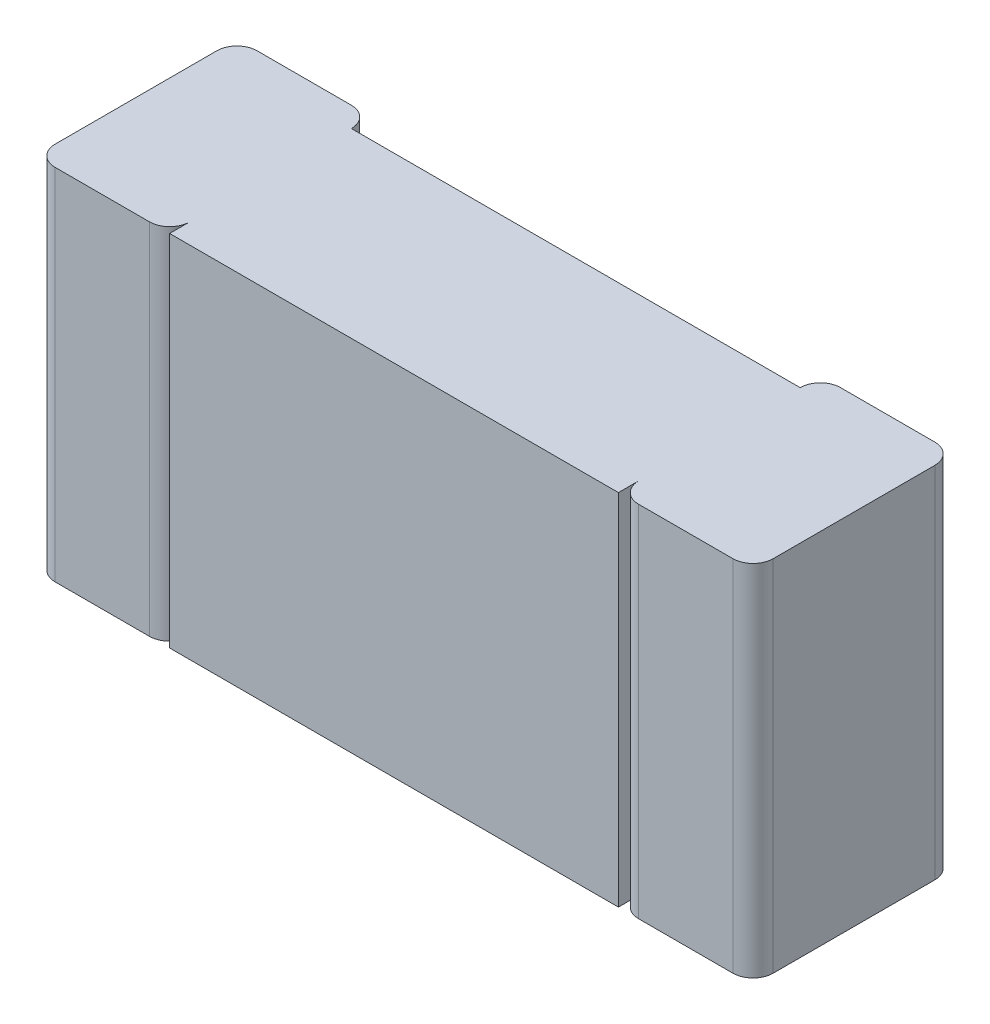
ISO-10303-21;
HEADER;
FILE_DESCRIPTION(('STEP AP214'),'2;1');
FILE_NAME('part.step','',(''),(''),'','','');
FILE_SCHEMA(('AUTOMOTIVE_DESIGN { 1 0 10303 214 1 1 1 1 }'));
ENDSEC;
DATA;
#1=APPLICATION_CONTEXT('core data for automotive mechanical design processes');
#2=APPLICATION_PROTOCOL_DEFINITION('international standard','automotive_design',2000,#1);
#3=PRODUCT_CONTEXT('',#1,'mechanical');
#4=PRODUCT('Part','Part','',(#3));
#5=PRODUCT_RELATED_PRODUCT_CATEGORY('part','',(#4));
#6=PRODUCT_DEFINITION_FORMATION('','',#4);
#7=PRODUCT_DEFINITION_CONTEXT('part definition',#1,'design');
#8=PRODUCT_DEFINITION('design','',#6,#7);
#9=PRODUCT_DEFINITION_SHAPE('','',#8);
#10=(LENGTH_UNIT() NAMED_UNIT(*) SI_UNIT(.MILLI.,.METRE.));
#11=(NAMED_UNIT(*) PLANE_ANGLE_UNIT() SI_UNIT($,.RADIAN.));
#12=(NAMED_UNIT(*) SI_UNIT($,.STERADIAN.) SOLID_ANGLE_UNIT());
#13=UNCERTAINTY_MEASURE_WITH_UNIT(LENGTH_MEASURE(1.E-05),#10,'distance_accuracy_value','');
#14=(GEOMETRIC_REPRESENTATION_CONTEXT(3) GLOBAL_UNCERTAINTY_ASSIGNED_CONTEXT((#13)) GLOBAL_UNIT_ASSIGNED_CONTEXT((#10,
#11,#12)) REPRESENTATION_CONTEXT('',''));
#15=CARTESIAN_POINT('',(0.,0.,0.));
#16=DIRECTION('',(0.,0.,1.));
#17=DIRECTION('',(1.,0.,0.));
#18=AXIS2_PLACEMENT_3D('',#15,#16,#17);
#19=CARTESIAN_POINT('',(-0.755,-0.4,0.045));
#20=DIRECTION('',(0.,1.,0.));
#21=DIRECTION('',(0.,0.,1.));
#22=AXIS2_PLACEMENT_3D('',#19,#20,#21);
#23=CYLINDRICAL_SURFACE('',#22,0.045);
#24=DIRECTION('',(0.,1.,0.));
#25=VECTOR('',#24,1.);
#26=CARTESIAN_POINT('',(-0.755,-0.4,0.));
#27=LINE('',#26,#25);
#28=CARTESIAN_POINT('',(-0.755,0.4,0.));
#29=VERTEX_POINT('',#28);
#30=CARTESIAN_POINT('',(-0.755,-0.4,0.));
#31=VERTEX_POINT('',#30);
#32=EDGE_CURVE('E129',#29,#31,#27,.F.);
#33=ORIENTED_EDGE('',*,*,#32,.T.);
#34=CARTESIAN_POINT('',(-0.755,-0.4,0.045));
#35=DIRECTION('',(0.,1.,0.));
#36=DIRECTION('',(0.,0.,1.));
#37=AXIS2_PLACEMENT_3D('',#34,#35,#36);
#38=CIRCLE('',#37,0.045);
#39=CARTESIAN_POINT('',(-0.8,-0.4,0.045));
#40=VERTEX_POINT('',#39);
#41=EDGE_CURVE('E20',#31,#40,#38,.T.);
#42=ORIENTED_EDGE('',*,*,#41,.T.);
#43=DIRECTION('',(0.,1.,0.));
#44=VECTOR('',#43,1.);
#45=CARTESIAN_POINT('',(-0.8,-0.4,0.045));
#46=LINE('',#45,#44);
#47=CARTESIAN_POINT('',(-0.8,0.4,0.045));
#48=VERTEX_POINT('',#47);
#49=EDGE_CURVE('E136',#40,#48,#46,.T.);
#50=ORIENTED_EDGE('',*,*,#49,.T.);
#51=CARTESIAN_POINT('',(-0.755,0.4,0.045));
#52=DIRECTION('',(0.,1.,0.));
#53=DIRECTION('',(0.,0.,1.));
#54=AXIS2_PLACEMENT_3D('',#51,#52,#53);
#55=CIRCLE('',#54,0.045);
#56=EDGE_CURVE('E232',#29,#48,#55,.T.);
#57=ORIENTED_EDGE('',*,*,#56,.F.);
#58=EDGE_LOOP('',(#33,#42,#50,#57));
#59=FACE_BOUND('',#58,.T.);
#60=ADVANCED_FACE('F17',(#59),#23,.T.);
#61=CARTESIAN_POINT('',(-0.8,-0.4,0.));
#62=DIRECTION('',(1.,0.,0.));
#63=DIRECTION('',(0.,0.,-1.));
#64=AXIS2_PLACEMENT_3D('',#61,#62,#63);
#65=PLANE('',#64);
#66=DIRECTION('',(0.,0.,1.));
#67=VECTOR('',#66,1.);
#68=CARTESIAN_POINT('',(-0.8,0.4,0.));
#69=LINE('',#68,#67);
#70=CARTESIAN_POINT('',(-0.8,0.4,0.405));
#71=VERTEX_POINT('',#70);
#72=EDGE_CURVE('E141',#48,#71,#69,.T.);
#73=ORIENTED_EDGE('',*,*,#72,.F.);
#74=ORIENTED_EDGE('',*,*,#49,.F.);
#75=DIRECTION('',(0.,0.,1.));
#76=VECTOR('',#75,1.);
#77=CARTESIAN_POINT('',(-0.8,-0.4,0.));
#78=LINE('',#77,#76);
#79=CARTESIAN_POINT('',(-0.8,-0.4,0.405));
#80=VERTEX_POINT('',#79);
#81=EDGE_CURVE('E140',#40,#80,#78,.T.);
#82=ORIENTED_EDGE('',*,*,#81,.T.);
#83=DIRECTION('',(0.,1.,0.));
#84=VECTOR('',#83,1.);
#85=CARTESIAN_POINT('',(-0.8,-0.4,0.405));
#86=LINE('',#85,#84);
#87=EDGE_CURVE('E142',#71,#80,#86,.F.);
#88=ORIENTED_EDGE('',*,*,#87,.F.);
#89=EDGE_LOOP('',(#73,#74,#82,#88));
#90=FACE_BOUND('',#89,.T.);
#91=ADVANCED_FACE('F138',(#90),#65,.F.);
#92=CARTESIAN_POINT('',(-0.755,-0.4,0.405));
#93=DIRECTION('',(0.,1.,0.));
#94=DIRECTION('',(0.,0.,1.));
#95=AXIS2_PLACEMENT_3D('',#92,#93,#94);
#96=CYLINDRICAL_SURFACE('',#95,0.045);
#97=CARTESIAN_POINT('',(-0.755,0.4,0.405));
#98=DIRECTION('',(0.,1.,0.));
#99=DIRECTION('',(0.,0.,1.));
#100=AXIS2_PLACEMENT_3D('',#97,#98,#99);
#101=CIRCLE('',#100,0.045);
#102=CARTESIAN_POINT('',(-0.755,0.4,0.45));
#103=VERTEX_POINT('',#102);
#104=EDGE_CURVE('E230',#71,#103,#101,.T.);
#105=ORIENTED_EDGE('',*,*,#104,.F.);
#106=ORIENTED_EDGE('',*,*,#87,.T.);
#107=CARTESIAN_POINT('',(-0.755,-0.4,0.405));
#108=DIRECTION('',(0.,1.,0.));
#109=DIRECTION('',(0.,0.,1.));
#110=AXIS2_PLACEMENT_3D('',#107,#108,#109);
#111=CIRCLE('',#110,0.045);
#112=CARTESIAN_POINT('',(-0.755,-0.4,0.45));
#113=VERTEX_POINT('',#112);
#114=EDGE_CURVE('E151',#80,#113,#111,.T.);
#115=ORIENTED_EDGE('',*,*,#114,.T.);
#116=DIRECTION('',(0.,1.,0.));
#117=VECTOR('',#116,1.);
#118=CARTESIAN_POINT('',(-0.755,-0.4,0.45));
#119=LINE('',#118,#117);
#120=EDGE_CURVE('E200',#103,#113,#119,.F.);
#121=ORIENTED_EDGE('',*,*,#120,.F.);
#122=EDGE_LOOP('',(#105,#106,#115,#121));
#123=FACE_BOUND('',#122,.T.);
#124=ADVANCED_FACE('F452',(#123),#96,.T.);
#125=CARTESIAN_POINT('',(-0.8,-0.4,0.45));
#126=DIRECTION('',(0.,0.,1.));
#127=DIRECTION('',(1.,0.,0.));
#128=AXIS2_PLACEMENT_3D('',#125,#126,#127);
#129=PLANE('',#128);
#130=DIRECTION('',(1.,0.,0.));
#131=VECTOR('',#130,1.);
#132=CARTESIAN_POINT('',(-0.8,-0.4,0.45));
#133=LINE('',#132,#131);
#134=CARTESIAN_POINT('',(-0.545,-0.4,0.45));
#135=VERTEX_POINT('',#134);
#136=EDGE_CURVE('E248',#113,#135,#133,.T.);
#137=ORIENTED_EDGE('',*,*,#136,.T.);
#138=DIRECTION('',(0.,1.,0.));
#139=VECTOR('',#138,1.);
#140=CARTESIAN_POINT('',(-0.545,-0.4,0.45));
#141=LINE('',#140,#139);
#142=CARTESIAN_POINT('',(-0.545,0.4,0.45));
#143=VERTEX_POINT('',#142);
#144=EDGE_CURVE('E198',#143,#135,#141,.F.);
#145=ORIENTED_EDGE('',*,*,#144,.F.);
#146=DIRECTION('',(1.,0.,0.));
#147=VECTOR('',#146,1.);
#148=CARTESIAN_POINT('',(-0.8,0.4,0.45));
#149=LINE('',#148,#147);
#150=EDGE_CURVE('E229',#103,#143,#149,.T.);
#151=ORIENTED_EDGE('',*,*,#150,.F.);
#152=ORIENTED_EDGE('',*,*,#120,.T.);
#153=EDGE_LOOP('',(#137,#145,#151,#152));
#154=FACE_BOUND('',#153,.T.);
#155=ADVANCED_FACE('F442',(#154),#129,.T.);
#156=CARTESIAN_POINT('',(-0.545,-0.4,0.405));
#157=DIRECTION('',(0.,1.,0.));
#158=DIRECTION('',(0.,0.,1.));
#159=AXIS2_PLACEMENT_3D('',#156,#157,#158);
#160=CYLINDRICAL_SURFACE('',#159,0.045);
#161=ORIENTED_EDGE('',*,*,#144,.T.);
#162=CARTESIAN_POINT('',(-0.545,-0.4,0.405));
#163=DIRECTION('',(0.,1.,0.));
#164=DIRECTION('',(0.,0.,1.));
#165=AXIS2_PLACEMENT_3D('',#162,#163,#164);
#166=CIRCLE('',#165,0.045);
#167=CARTESIAN_POINT('',(-0.5,-0.4,0.405));
#168=VERTEX_POINT('',#167);
#169=EDGE_CURVE('E246',#135,#168,#166,.T.);
#170=ORIENTED_EDGE('',*,*,#169,.T.);
#171=DIRECTION('',(0.,1.,0.));
#172=VECTOR('',#171,1.);
#173=CARTESIAN_POINT('',(-0.5,-0.4,0.405));
#174=LINE('',#173,#172);
#175=CARTESIAN_POINT('',(-0.5,0.4,0.405));
#176=VERTEX_POINT('',#175);
#177=EDGE_CURVE('E193',#168,#176,#174,.T.);
#178=ORIENTED_EDGE('',*,*,#177,.T.);
#179=CARTESIAN_POINT('',(-0.545,0.4,0.405));
#180=DIRECTION('',(0.,1.,0.));
#181=DIRECTION('',(0.,0.,1.));
#182=AXIS2_PLACEMENT_3D('',#179,#180,#181);
#183=CIRCLE('',#182,0.045);
#184=EDGE_CURVE('E227',#143,#176,#183,.T.);
#185=ORIENTED_EDGE('',*,*,#184,.F.);
#186=EDGE_LOOP('',(#161,#170,#178,#185));
#187=FACE_BOUND('',#186,.T.);
#188=ADVANCED_FACE('F430',(#187),#160,.T.);
#189=CARTESIAN_POINT('',(-0.5,-0.4,0.405));
#190=DIRECTION('',(1.,0.,0.));
#191=DIRECTION('',(0.,0.,-1.));
#192=AXIS2_PLACEMENT_3D('',#189,#190,#191);
#193=PLANE('',#192);
#194=DIRECTION('',(0.,0.,1.));
#195=VECTOR('',#194,1.);
#196=CARTESIAN_POINT('',(-0.5,0.4,0.405));
#197=LINE('',#196,#195);
#198=CARTESIAN_POINT('',(-0.5,0.4,0.45));
#199=VERTEX_POINT('',#198);
#200=EDGE_CURVE('E188',#176,#199,#197,.T.);
#201=ORIENTED_EDGE('',*,*,#200,.F.);
#202=ORIENTED_EDGE('',*,*,#177,.F.);
#203=DIRECTION('',(0.,0.,1.));
#204=VECTOR('',#203,1.);
#205=CARTESIAN_POINT('',(-0.5,-0.4,0.405));
#206=LINE('',#205,#204);
#207=CARTESIAN_POINT('',(-0.5,-0.4,0.45));
#208=VERTEX_POINT('',#207);
#209=EDGE_CURVE('E206',#168,#208,#206,.T.);
#210=ORIENTED_EDGE('',*,*,#209,.T.);
#211=DIRECTION('',(0.,1.,0.));
#212=VECTOR('',#211,1.);
#213=CARTESIAN_POINT('',(-0.5,-0.4,0.45));
#214=LINE('',#213,#212);
#215=EDGE_CURVE('E181',#199,#208,#214,.F.);
#216=ORIENTED_EDGE('',*,*,#215,.F.);
#217=EDGE_LOOP('',(#201,#202,#210,#216));
#218=FACE_BOUND('',#217,.T.);
#219=ADVANCED_FACE('F420',(#218),#193,.F.);
#220=CARTESIAN_POINT('',(-0.5,-0.4,0.45));
#221=DIRECTION('',(0.,0.,1.));
#222=DIRECTION('',(1.,0.,0.));
#223=AXIS2_PLACEMENT_3D('',#220,#221,#222);
#224=PLANE('',#223);
#225=DIRECTION('',(0.,1.,0.));
#226=VECTOR('',#225,1.);
#227=CARTESIAN_POINT('',(0.5,-0.4,0.45));
#228=LINE('',#227,#226);
#229=CARTESIAN_POINT('',(0.5,0.4,0.45));
#230=VERTEX_POINT('',#229);
#231=CARTESIAN_POINT('',(0.5,-0.4,0.45));
#232=VERTEX_POINT('',#231);
#233=EDGE_CURVE('E174',#230,#232,#228,.F.);
#234=ORIENTED_EDGE('',*,*,#233,.F.);
#235=DIRECTION('',(1.,0.,0.));
#236=VECTOR('',#235,1.);
#237=CARTESIAN_POINT('',(-0.5,0.4,0.45));
#238=LINE('',#237,#236);
#239=EDGE_CURVE('E184',#199,#230,#238,.T.);
#240=ORIENTED_EDGE('',*,*,#239,.F.);
#241=ORIENTED_EDGE('',*,*,#215,.T.);
#242=DIRECTION('',(1.,0.,0.));
#243=VECTOR('',#242,1.);
#244=CARTESIAN_POINT('',(-0.5,-0.4,0.45));
#245=LINE('',#244,#243);
#246=EDGE_CURVE('E203',#208,#232,#245,.T.);
#247=ORIENTED_EDGE('',*,*,#246,.T.);
#248=EDGE_LOOP('',(#234,#240,#241,#247));
#249=FACE_BOUND('',#248,.T.);
#250=ADVANCED_FACE('F407',(#249),#224,.T.);
#251=CARTESIAN_POINT('',(0.5,-0.4,0.405));
#252=DIRECTION('',(1.,0.,0.));
#253=DIRECTION('',(0.,0.,-1.));
#254=AXIS2_PLACEMENT_3D('',#251,#252,#253);
#255=PLANE('',#254);
#256=DIRECTION('',(0.,0.,1.));
#257=VECTOR('',#256,1.);
#258=CARTESIAN_POINT('',(0.5,0.4,0.405));
#259=LINE('',#258,#257);
#260=CARTESIAN_POINT('',(0.5,0.4,0.405));
#261=VERTEX_POINT('',#260);
#262=EDGE_CURVE('E187',#230,#261,#259,.F.);
#263=ORIENTED_EDGE('',*,*,#262,.F.);
#264=ORIENTED_EDGE('',*,*,#233,.T.);
#265=DIRECTION('',(0.,0.,1.));
#266=VECTOR('',#265,1.);
#267=CARTESIAN_POINT('',(0.5,-0.4,0.405));
#268=LINE('',#267,#266);
#269=CARTESIAN_POINT('',(0.5,-0.4,0.405));
#270=VERTEX_POINT('',#269);
#271=EDGE_CURVE('E178',#232,#270,#268,.F.);
#272=ORIENTED_EDGE('',*,*,#271,.T.);
#273=DIRECTION('',(0.,1.,0.));
#274=VECTOR('',#273,1.);
#275=CARTESIAN_POINT('',(0.5,-0.4,0.405));
#276=LINE('',#275,#274);
#277=EDGE_CURVE('E172',#261,#270,#276,.F.);
#278=ORIENTED_EDGE('',*,*,#277,.F.);
#279=EDGE_LOOP('',(#263,#264,#272,#278));
#280=FACE_BOUND('',#279,.T.);
#281=ADVANCED_FACE('F375',(#280),#255,.T.);
#282=CARTESIAN_POINT('',(0.545,-0.4,0.405));
#283=DIRECTION('',(0.,1.,0.));
#284=DIRECTION('',(0.,0.,1.));
#285=AXIS2_PLACEMENT_3D('',#282,#283,#284);
#286=CYLINDRICAL_SURFACE('',#285,0.045);
#287=CARTESIAN_POINT('',(0.545,0.4,0.405));
#288=DIRECTION('',(0.,1.,0.));
#289=DIRECTION('',(0.,0.,1.));
#290=AXIS2_PLACEMENT_3D('',#287,#288,#289);
#291=CIRCLE('',#290,0.045);
#292=CARTESIAN_POINT('',(0.545,0.4,0.45));
#293=VERTEX_POINT('',#292);
#294=EDGE_CURVE('E224',#261,#293,#291,.T.);
#295=ORIENTED_EDGE('',*,*,#294,.F.);
#296=ORIENTED_EDGE('',*,*,#277,.T.);
#297=CARTESIAN_POINT('',(0.545,-0.4,0.405));
#298=DIRECTION('',(0.,1.,0.));
#299=DIRECTION('',(0.,0.,1.));
#300=AXIS2_PLACEMENT_3D('',#297,#298,#299);
#301=CIRCLE('',#300,0.045);
#302=CARTESIAN_POINT('',(0.545,-0.4,0.45));
#303=VERTEX_POINT('',#302);
#304=EDGE_CURVE('E243',#270,#303,#301,.T.);
#305=ORIENTED_EDGE('',*,*,#304,.T.);
#306=DIRECTION('',(0.,1.,0.));
#307=VECTOR('',#306,1.);
#308=CARTESIAN_POINT('',(0.545,-0.4,0.45));
#309=LINE('',#308,#307);
#310=EDGE_CURVE('E170',#293,#303,#309,.F.);
#311=ORIENTED_EDGE('',*,*,#310,.F.);
#312=EDGE_LOOP('',(#295,#296,#305,#311));
#313=FACE_BOUND('',#312,.T.);
#314=ADVANCED_FACE('F406',(#313),#286,.T.);
#315=CARTESIAN_POINT('',(0.5,-0.4,0.45));
#316=DIRECTION('',(0.,0.,1.));
#317=DIRECTION('',(1.,0.,0.));
#318=AXIS2_PLACEMENT_3D('',#315,#316,#317);
#319=PLANE('',#318);
#320=DIRECTION('',(1.,0.,0.));
#321=VECTOR('',#320,1.);
#322=CARTESIAN_POINT('',(0.5,-0.4,0.45));
#323=LINE('',#322,#321);
#324=CARTESIAN_POINT('',(0.755,-0.4,0.45));
#325=VERTEX_POINT('',#324);
#326=EDGE_CURVE('E242',#303,#325,#323,.T.);
#327=ORIENTED_EDGE('',*,*,#326,.T.);
#328=DIRECTION('',(0.,1.,0.));
#329=VECTOR('',#328,1.);
#330=CARTESIAN_POINT('',(0.755,-0.4,0.45));
#331=LINE('',#330,#329);
#332=CARTESIAN_POINT('',(0.755,0.4,0.45));
#333=VERTEX_POINT('',#332);
#334=EDGE_CURVE('E168',#333,#325,#331,.F.);
#335=ORIENTED_EDGE('',*,*,#334,.F.);
#336=DIRECTION('',(1.,0.,0.));
#337=VECTOR('',#336,1.);
#338=CARTESIAN_POINT('',(0.5,0.4,0.45));
#339=LINE('',#338,#337);
#340=EDGE_CURVE('E223',#293,#333,#339,.T.);
#341=ORIENTED_EDGE('',*,*,#340,.F.);
#342=ORIENTED_EDGE('',*,*,#310,.T.);
#343=EDGE_LOOP('',(#327,#335,#341,#342));
#344=FACE_BOUND('',#343,.T.);
#345=ADVANCED_FACE('F483',(#344),#319,.T.);
#346=CARTESIAN_POINT('',(0.755,-0.4,0.405));
#347=DIRECTION('',(0.,1.,0.));
#348=DIRECTION('',(0.,0.,1.));
#349=AXIS2_PLACEMENT_3D('',#346,#347,#348);
#350=CYLINDRICAL_SURFACE('',#349,0.045);
#351=ORIENTED_EDGE('',*,*,#334,.T.);
#352=CARTESIAN_POINT('',(0.755,-0.4,0.405));
#353=DIRECTION('',(0.,1.,0.));
#354=DIRECTION('',(0.,0.,1.));
#355=AXIS2_PLACEMENT_3D('',#352,#353,#354);
#356=CIRCLE('',#355,0.045);
#357=CARTESIAN_POINT('',(0.8,-0.4,0.405));
#358=VERTEX_POINT('',#357);
#359=EDGE_CURVE('E239',#325,#358,#356,.T.);
#360=ORIENTED_EDGE('',*,*,#359,.T.);
#361=DIRECTION('',(0.,1.,0.));
#362=VECTOR('',#361,1.);
#363=CARTESIAN_POINT('',(0.8,-0.4,0.405));
#364=LINE('',#363,#362);
#365=CARTESIAN_POINT('',(0.8,0.4,0.405));
#366=VERTEX_POINT('',#365);
#367=EDGE_CURVE('E166',#366,#358,#364,.F.);
#368=ORIENTED_EDGE('',*,*,#367,.F.);
#369=CARTESIAN_POINT('',(0.755,0.4,0.405));
#370=DIRECTION('',(0.,1.,0.));
#371=DIRECTION('',(0.,0.,1.));
#372=AXIS2_PLACEMENT_3D('',#369,#370,#371);
#373=CIRCLE('',#372,0.045);
#374=EDGE_CURVE('E221',#333,#366,#373,.T.);
#375=ORIENTED_EDGE('',*,*,#374,.F.);
#376=EDGE_LOOP('',(#351,#360,#368,#375));
#377=FACE_BOUND('',#376,.T.);
#378=ADVANCED_FACE('F487',(#377),#350,.T.);
#379=CARTESIAN_POINT('',(0.8,-0.4,0.));
#380=DIRECTION('',(1.,0.,0.));
#381=DIRECTION('',(0.,0.,-1.));
#382=AXIS2_PLACEMENT_3D('',#379,#380,#381);
#383=PLANE('',#382);
#384=DIRECTION('',(0.,0.,1.));
#385=VECTOR('',#384,1.);
#386=CARTESIAN_POINT('',(0.8,0.4,0.));
#387=LINE('',#386,#385);
#388=CARTESIAN_POINT('',(0.8,0.4,0.045));
#389=VERTEX_POINT('',#388);
#390=EDGE_CURVE('E220',#366,#389,#387,.F.);
#391=ORIENTED_EDGE('',*,*,#390,.F.);
#392=ORIENTED_EDGE('',*,*,#367,.T.);
#393=DIRECTION('',(0.,0.,1.));
#394=VECTOR('',#393,1.);
#395=CARTESIAN_POINT('',(0.8,-0.4,0.));
#396=LINE('',#395,#394);
#397=CARTESIAN_POINT('',(0.8,-0.4,0.045));
#398=VERTEX_POINT('',#397);
#399=EDGE_CURVE('E238',#358,#398,#396,.F.);
#400=ORIENTED_EDGE('',*,*,#399,.T.);
#401=DIRECTION('',(0.,1.,0.));
#402=VECTOR('',#401,1.);
#403=CARTESIAN_POINT('',(0.8,-0.4,0.045));
#404=LINE('',#403,#402);
#405=EDGE_CURVE('E157',#389,#398,#404,.F.);
#406=ORIENTED_EDGE('',*,*,#405,.F.);
#407=EDGE_LOOP('',(#391,#392,#400,#406));
#408=FACE_BOUND('',#407,.T.);
#409=ADVANCED_FACE('F298',(#408),#383,.T.);
#410=CARTESIAN_POINT('',(0.755,-0.4,0.045));
#411=DIRECTION('',(0.,1.,0.));
#412=DIRECTION('',(0.,0.,1.));
#413=AXIS2_PLACEMENT_3D('',#410,#411,#412);
#414=CYLINDRICAL_SURFACE('',#413,0.045);
#415=CARTESIAN_POINT('',(0.755,0.4,0.045));
#416=DIRECTION('',(0.,1.,0.));
#417=DIRECTION('',(0.,0.,1.));
#418=AXIS2_PLACEMENT_3D('',#415,#416,#417);
#419=CIRCLE('',#418,0.045);
#420=CARTESIAN_POINT('',(0.755,0.4,0.));
#421=VERTEX_POINT('',#420);
#422=EDGE_CURVE('E217',#389,#421,#419,.T.);
#423=ORIENTED_EDGE('',*,*,#422,.F.);
#424=ORIENTED_EDGE('',*,*,#405,.T.);
#425=CARTESIAN_POINT('',(0.755,-0.4,0.045));
#426=DIRECTION('',(0.,1.,0.));
#427=DIRECTION('',(0.,0.,1.));
#428=AXIS2_PLACEMENT_3D('',#425,#426,#427);
#429=CIRCLE('',#428,0.045);
#430=CARTESIAN_POINT('',(0.755,-0.4,0.));
#431=VERTEX_POINT('',#430);
#432=EDGE_CURVE('E235',#398,#431,#429,.T.);
#433=ORIENTED_EDGE('',*,*,#432,.T.);
#434=DIRECTION('',(0.,1.,0.));
#435=VECTOR('',#434,1.);
#436=CARTESIAN_POINT('',(0.755,-0.4,0.));
#437=LINE('',#436,#435);
#438=EDGE_CURVE('E175',#431,#421,#437,.T.);
#439=ORIENTED_EDGE('',*,*,#438,.T.);
#440=EDGE_LOOP('',(#423,#424,#433,#439));
#441=FACE_BOUND('',#440,.T.);
#442=ADVANCED_FACE('F302',(#441),#414,.T.);
#443=CARTESIAN_POINT('',(-0.8,-0.4,0.));
#444=DIRECTION('',(0.,0.,1.));
#445=DIRECTION('',(1.,0.,0.));
#446=AXIS2_PLACEMENT_3D('',#443,#444,#445);
#447=PLANE('',#446);
#448=DIRECTION('',(1.,0.,0.));
#449=VECTOR('',#448,1.);
#450=CARTESIAN_POINT('',(-0.8,-0.4,0.));
#451=LINE('',#450,#449);
#452=CARTESIAN_POINT('',(-0.545,-0.4,0.));
#453=VERTEX_POINT('',#452);
#454=EDGE_CURVE('E153',#453,#31,#451,.F.);
#455=ORIENTED_EDGE('',*,*,#454,.T.);
#456=ORIENTED_EDGE('',*,*,#32,.F.);
#457=DIRECTION('',(1.,0.,0.));
#458=VECTOR('',#457,1.);
#459=CARTESIAN_POINT('',(-0.8,0.4,0.));
#460=LINE('',#459,#458);
#461=CARTESIAN_POINT('',(-0.545,0.4,0.));
#462=VERTEX_POINT('',#461);
#463=EDGE_CURVE('E234',#462,#29,#460,.F.);
#464=ORIENTED_EDGE('',*,*,#463,.F.);
#465=DIRECTION('',(0.,1.,0.));
#466=VECTOR('',#465,1.);
#467=CARTESIAN_POINT('',(-0.545,-0.4,0.));
#468=LINE('',#467,#466);
#469=EDGE_CURVE('E161',#453,#462,#468,.T.);
#470=ORIENTED_EDGE('',*,*,#469,.F.);
#471=EDGE_LOOP('',(#455,#456,#464,#470));
#472=FACE_BOUND('',#471,.T.);
#473=ADVANCED_FACE('F319',(#472),#447,.F.);
#474=CARTESIAN_POINT('',(0.5,-0.4,0.));
#475=DIRECTION('',(0.,0.,1.));
#476=DIRECTION('',(1.,0.,0.));
#477=AXIS2_PLACEMENT_3D('',#474,#475,#476);
#478=PLANE('',#477);
#479=DIRECTION('',(1.,0.,0.));
#480=VECTOR('',#479,1.);
#481=CARTESIAN_POINT('',(0.5,-0.4,0.));
#482=LINE('',#481,#480);
#483=CARTESIAN_POINT('',(0.545,-0.4,0.));
#484=VERTEX_POINT('',#483);
#485=EDGE_CURVE('E177',#431,#484,#482,.F.);
#486=ORIENTED_EDGE('',*,*,#485,.T.);
#487=DIRECTION('',(0.,1.,0.));
#488=VECTOR('',#487,1.);
#489=CARTESIAN_POINT('',(0.545,-0.4,0.));
#490=LINE('',#489,#488);
#491=CARTESIAN_POINT('',(0.545,0.4,0.));
#492=VERTEX_POINT('',#491);
#493=EDGE_CURVE('E212',#492,#484,#490,.F.);
#494=ORIENTED_EDGE('',*,*,#493,.F.);
#495=DIRECTION('',(1.,0.,0.));
#496=VECTOR('',#495,1.);
#497=CARTESIAN_POINT('',(0.5,0.4,0.));
#498=LINE('',#497,#496);
#499=EDGE_CURVE('E226',#421,#492,#498,.F.);
#500=ORIENTED_EDGE('',*,*,#499,.F.);
#501=ORIENTED_EDGE('',*,*,#438,.F.);
#502=EDGE_LOOP('',(#486,#494,#500,#501));
#503=FACE_BOUND('',#502,.T.);
#504=ADVANCED_FACE('F305',(#503),#478,.F.);
#505=CARTESIAN_POINT('',(-0.545,-0.4,0.045));
#506=DIRECTION('',(0.,1.,0.));
#507=DIRECTION('',(0.,0.,1.));
#508=AXIS2_PLACEMENT_3D('',#505,#506,#507);
#509=CYLINDRICAL_SURFACE('',#508,0.045);
#510=CARTESIAN_POINT('',(-0.545,0.4,0.045));
#511=DIRECTION('',(0.,1.,0.));
#512=DIRECTION('',(0.,0.,1.));
#513=AXIS2_PLACEMENT_3D('',#510,#511,#512);
#514=CIRCLE('',#513,0.045);
#515=CARTESIAN_POINT('',(-0.5,0.4,0.045));
#516=VERTEX_POINT('',#515);
#517=EDGE_CURVE('E163',#462,#516,#514,.F.);
#518=ORIENTED_EDGE('',*,*,#517,.T.);
#519=DIRECTION('',(0.,1.,0.));
#520=VECTOR('',#519,1.);
#521=CARTESIAN_POINT('',(-0.5,-0.4,0.045));
#522=LINE('',#521,#520);
#523=CARTESIAN_POINT('',(-0.5,-0.4,0.045));
#524=VERTEX_POINT('',#523);
#525=EDGE_CURVE('E211',#516,#524,#522,.F.);
#526=ORIENTED_EDGE('',*,*,#525,.T.);
#527=CARTESIAN_POINT('',(-0.545,-0.4,0.045));
#528=DIRECTION('',(0.,1.,0.));
#529=DIRECTION('',(0.,0.,1.));
#530=AXIS2_PLACEMENT_3D('',#527,#528,#529);
#531=CIRCLE('',#530,0.045);
#532=EDGE_CURVE('E164',#524,#453,#531,.T.);
#533=ORIENTED_EDGE('',*,*,#532,.T.);
#534=ORIENTED_EDGE('',*,*,#469,.T.);
#535=EDGE_LOOP('',(#518,#526,#533,#534));
#536=FACE_BOUND('',#535,.T.);
#537=ADVANCED_FACE('F318',(#536),#509,.T.);
#538=CARTESIAN_POINT('',(-0.755,-0.4,0.045));
#539=DIRECTION('',(0.,1.,0.));
#540=DIRECTION('',(0.,0.,1.));
#541=AXIS2_PLACEMENT_3D('',#538,#539,#540);
#542=PLANE('',#541);
#543=DIRECTION('',(1.,0.,0.));
#544=VECTOR('',#543,1.);
#545=CARTESIAN_POINT('',(-0.755,-0.4,0.045));
#546=LINE('',#545,#544);
#547=CARTESIAN_POINT('',(0.5,-0.4,0.045));
#548=VERTEX_POINT('',#547);
#549=EDGE_CURVE('E263',#524,#548,#546,.T.);
#550=ORIENTED_EDGE('',*,*,#549,.T.);
#551=CARTESIAN_POINT('',(0.545,-0.4,0.045));
#552=DIRECTION('',(0.,1.,0.));
#553=DIRECTION('',(0.,0.,1.));
#554=AXIS2_PLACEMENT_3D('',#551,#552,#553);
#555=CIRCLE('',#554,0.045);
#556=EDGE_CURVE('E209',#484,#548,#555,.T.);
#557=ORIENTED_EDGE('',*,*,#556,.F.);
#558=ORIENTED_EDGE('',*,*,#485,.F.);
#559=ORIENTED_EDGE('',*,*,#432,.F.);
#560=ORIENTED_EDGE('',*,*,#399,.F.);
#561=ORIENTED_EDGE('',*,*,#359,.F.);
#562=ORIENTED_EDGE('',*,*,#326,.F.);
#563=ORIENTED_EDGE('',*,*,#304,.F.);
#564=ORIENTED_EDGE('',*,*,#271,.F.);
#565=ORIENTED_EDGE('',*,*,#246,.F.);
#566=ORIENTED_EDGE('',*,*,#209,.F.);
#567=ORIENTED_EDGE('',*,*,#169,.F.);
#568=ORIENTED_EDGE('',*,*,#136,.F.);
#569=ORIENTED_EDGE('',*,*,#114,.F.);
#570=ORIENTED_EDGE('',*,*,#81,.F.);
#571=ORIENTED_EDGE('',*,*,#41,.F.);
#572=ORIENTED_EDGE('',*,*,#454,.F.);
#573=ORIENTED_EDGE('',*,*,#532,.F.);
#574=EDGE_LOOP('',(#550,#557,#558,#559,#560,#561,#562,#563,#564,#565,#566,#567,#568,#569,#570,
#571,#572,#573));
#575=FACE_BOUND('',#574,.T.);
#576=ADVANCED_FACE('F147',(#575),#542,.F.);
#577=CARTESIAN_POINT('',(0.545,-0.4,0.045));
#578=DIRECTION('',(0.,1.,0.));
#579=DIRECTION('',(0.,0.,1.));
#580=AXIS2_PLACEMENT_3D('',#577,#578,#579);
#581=CYLINDRICAL_SURFACE('',#580,0.045);
#582=ORIENTED_EDGE('',*,*,#493,.T.);
#583=ORIENTED_EDGE('',*,*,#556,.T.);
#584=DIRECTION('',(0.,1.,0.));
#585=VECTOR('',#584,1.);
#586=CARTESIAN_POINT('',(0.5,-0.4,0.045));
#587=LINE('',#586,#585);
#588=CARTESIAN_POINT('',(0.5,0.4,0.045));
#589=VERTEX_POINT('',#588);
#590=EDGE_CURVE('E26',#548,#589,#587,.T.);
#591=ORIENTED_EDGE('',*,*,#590,.T.);
#592=CARTESIAN_POINT('',(0.545,0.4,0.045));
#593=DIRECTION('',(0.,1.,0.));
#594=DIRECTION('',(0.,0.,1.));
#595=AXIS2_PLACEMENT_3D('',#592,#593,#594);
#596=CIRCLE('',#595,0.045);
#597=EDGE_CURVE('E34',#589,#492,#596,.F.);
#598=ORIENTED_EDGE('',*,*,#597,.T.);
#599=EDGE_LOOP('',(#582,#583,#591,#598));
#600=FACE_BOUND('',#599,.T.);
#601=ADVANCED_FACE('F311',(#600),#581,.T.);
#602=CARTESIAN_POINT('',(-0.755,0.4,0.045));
#603=DIRECTION('',(0.,1.,0.));
#604=DIRECTION('',(0.,0.,1.));
#605=AXIS2_PLACEMENT_3D('',#602,#603,#604);
#606=PLANE('',#605);
#607=DIRECTION('',(1.,0.,0.));
#608=VECTOR('',#607,1.);
#609=CARTESIAN_POINT('',(-0.755,0.4,0.045));
#610=LINE('',#609,#608);
#611=EDGE_CURVE('E11',#589,#516,#610,.F.);
#612=ORIENTED_EDGE('',*,*,#611,.T.);
#613=ORIENTED_EDGE('',*,*,#517,.F.);
#614=ORIENTED_EDGE('',*,*,#463,.T.);
#615=ORIENTED_EDGE('',*,*,#56,.T.);
#616=ORIENTED_EDGE('',*,*,#72,.T.);
#617=ORIENTED_EDGE('',*,*,#104,.T.);
#618=ORIENTED_EDGE('',*,*,#150,.T.);
#619=ORIENTED_EDGE('',*,*,#184,.T.);
#620=ORIENTED_EDGE('',*,*,#200,.T.);
#621=ORIENTED_EDGE('',*,*,#239,.T.);
#622=ORIENTED_EDGE('',*,*,#262,.T.);
#623=ORIENTED_EDGE('',*,*,#294,.T.);
#624=ORIENTED_EDGE('',*,*,#340,.T.);
#625=ORIENTED_EDGE('',*,*,#374,.T.);
#626=ORIENTED_EDGE('',*,*,#390,.T.);
#627=ORIENTED_EDGE('',*,*,#422,.T.);
#628=ORIENTED_EDGE('',*,*,#499,.T.);
#629=ORIENTED_EDGE('',*,*,#597,.F.);
#630=EDGE_LOOP('',(#612,#613,#614,#615,#616,#617,#618,#619,#620,#621,#622,#623,#624,#625,#626,
#627,#628,#629));
#631=FACE_BOUND('',#630,.T.);
#632=ADVANCED_FACE('F292',(#631),#606,.T.);
#633=CARTESIAN_POINT('',(-0.755,-0.4,0.045));
#634=DIRECTION('',(0.,0.,1.));
#635=DIRECTION('',(1.,0.,0.));
#636=AXIS2_PLACEMENT_3D('',#633,#634,#635);
#637=PLANE('',#636);
#638=ORIENTED_EDGE('',*,*,#590,.F.);
#639=ORIENTED_EDGE('',*,*,#549,.F.);
#640=ORIENTED_EDGE('',*,*,#525,.F.);
#641=ORIENTED_EDGE('',*,*,#611,.F.);
#642=EDGE_LOOP('',(#638,#639,#640,#641));
#643=FACE_BOUND('',#642,.T.);
#644=ADVANCED_FACE('F313',(#643),#637,.F.);
#645=CLOSED_SHELL('',(#60,#91,#124,#155,#188,#219,#250,#281,#314,#345,#378,#409,#442,#473,#504,
#537,#576,#601,#632,#644));
#646=MANIFOLD_SOLID_BREP('B1',#645);
#647=ADVANCED_BREP_SHAPE_REPRESENTATION('',(#18,#646),#14);
#648=SHAPE_DEFINITION_REPRESENTATION(#9,#647);
ENDSEC;
END-ISO-10303-21;
